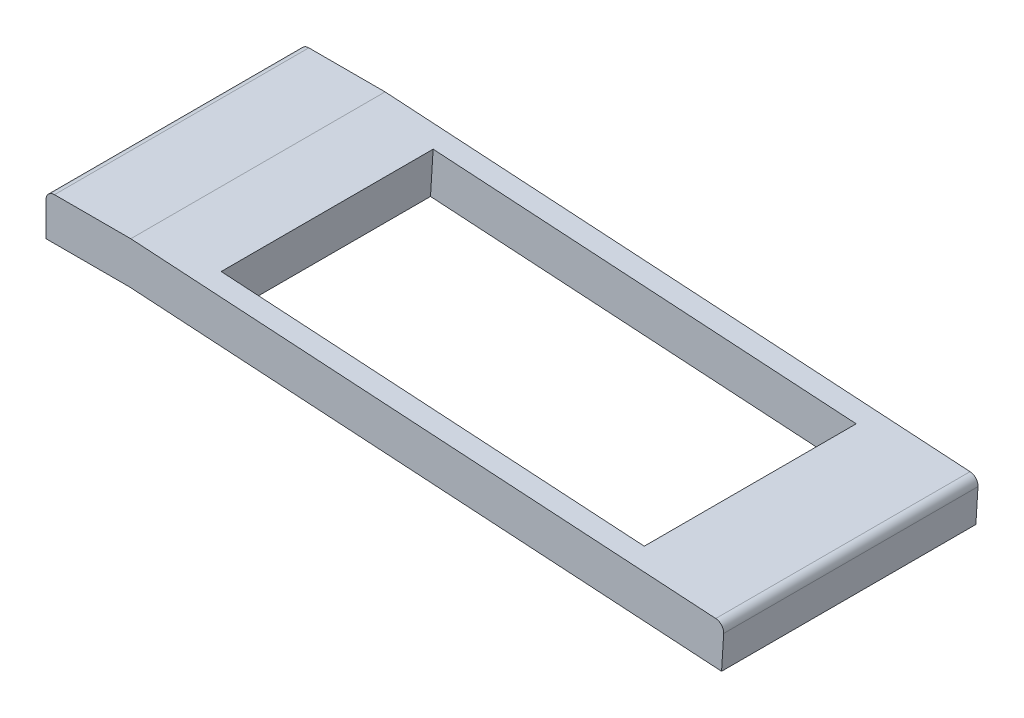
ISO-10303-21;
HEADER;
FILE_DESCRIPTION(('STEP AP214'),'2;1');
FILE_NAME('part.step','',(''),(''),'','','');
FILE_SCHEMA(('AUTOMOTIVE_DESIGN { 1 0 10303 214 1 1 1 1 }'));
ENDSEC;
DATA;
#1=APPLICATION_CONTEXT('core data for automotive mechanical design processes');
#2=APPLICATION_PROTOCOL_DEFINITION('international standard','automotive_design',2000,#1);
#3=PRODUCT_CONTEXT('',#1,'mechanical');
#4=PRODUCT('Part','Part','',(#3));
#5=PRODUCT_RELATED_PRODUCT_CATEGORY('part','',(#4));
#6=PRODUCT_DEFINITION_FORMATION('','',#4);
#7=PRODUCT_DEFINITION_CONTEXT('part definition',#1,'design');
#8=PRODUCT_DEFINITION('design','',#6,#7);
#9=PRODUCT_DEFINITION_SHAPE('','',#8);
#10=(LENGTH_UNIT() NAMED_UNIT(*) SI_UNIT(.MILLI.,.METRE.));
#11=(NAMED_UNIT(*) PLANE_ANGLE_UNIT() SI_UNIT($,.RADIAN.));
#12=(NAMED_UNIT(*) SI_UNIT($,.STERADIAN.) SOLID_ANGLE_UNIT());
#13=UNCERTAINTY_MEASURE_WITH_UNIT(LENGTH_MEASURE(1.E-05),#10,'distance_accuracy_value','');
#14=(GEOMETRIC_REPRESENTATION_CONTEXT(3) GLOBAL_UNCERTAINTY_ASSIGNED_CONTEXT((#13)) GLOBAL_UNIT_ASSIGNED_CONTEXT((#10,
#11,#12)) REPRESENTATION_CONTEXT('',''));
#15=CARTESIAN_POINT('',(0.,0.,0.));
#16=DIRECTION('',(0.,0.,1.));
#17=DIRECTION('',(1.,0.,0.));
#18=AXIS2_PLACEMENT_3D('',#15,#16,#17);
#19=CARTESIAN_POINT('',(1.,0.,3.));
#20=DIRECTION('',(-0.0621255689086749,-0.99806834119101,0.));
#21=DIRECTION('',(0.99806834119101,-0.0621255689086749,0.));
#22=AXIS2_PLACEMENT_3D('',#19,#20,#21);
#23=PLANE('',#22);
#24=DIRECTION('',(-0.99806834119101,0.0621255689086749,0.));
#25=VECTOR('',#24,1.);
#26=CARTESIAN_POINT('',(1.81747174696329,-0.0508841882373098,0.250788281548282));
#27=LINE('',#26,#25);
#28=CARTESIAN_POINT('',(6.80781345291834,-0.361512032780684,0.250788281548282));
#29=VERTEX_POINT('',#28);
#30=CARTESIAN_POINT('',(1.81747174696329,-0.0508841882373098,0.250788281548282));
#31=VERTEX_POINT('',#30);
#32=EDGE_CURVE('E145',#29,#31,#27,.T.);
#33=ORIENTED_EDGE('',*,*,#32,.F.);
#34=DIRECTION('',(0.,0.,-1.));
#35=VECTOR('',#34,1.);
#36=CARTESIAN_POINT('',(6.80781345291834,-0.361512032780684,0.250788281548282));
#37=LINE('',#36,#35);
#38=CARTESIAN_POINT('',(6.80781345291834,-0.361512032780684,2.75078828154828));
#39=VERTEX_POINT('',#38);
#40=EDGE_CURVE('E58',#39,#29,#37,.T.);
#41=ORIENTED_EDGE('',*,*,#40,.F.);
#42=DIRECTION('',(0.99806834119101,-0.0621255689086749,0.));
#43=VECTOR('',#42,1.);
#44=CARTESIAN_POINT('',(1.81747174696329,-0.0508841882373098,2.75078828154828));
#45=LINE('',#44,#43);
#46=CARTESIAN_POINT('',(1.81747174696329,-0.0508841882373098,2.75078828154828));
#47=VERTEX_POINT('',#46);
#48=EDGE_CURVE('E152',#47,#39,#45,.T.);
#49=ORIENTED_EDGE('',*,*,#48,.F.);
#50=DIRECTION('',(0.,0.,1.));
#51=VECTOR('',#50,1.);
#52=CARTESIAN_POINT('',(1.81747174696329,-0.0508841882373098,0.250788281548282));
#53=LINE('',#52,#51);
#54=EDGE_CURVE('E135',#31,#47,#53,.T.);
#55=ORIENTED_EDGE('',*,*,#54,.F.);
#56=EDGE_LOOP('',(#33,#41,#49,#55));
#57=FACE_BOUND('',#56,.T.);
#58=DIRECTION('',(-0.99806834119101,0.0621255689086749,0.));
#59=VECTOR('',#58,1.);
#60=CARTESIAN_POINT('',(1.,0.,0.));
#61=LINE('',#60,#59);
#62=CARTESIAN_POINT('',(7.9001931658809,-0.429508089093932,0.));
#63=VERTEX_POINT('',#62);
#64=CARTESIAN_POINT('',(1.,0.,0.));
#65=VERTEX_POINT('',#64);
#66=EDGE_CURVE('E162',#63,#65,#61,.T.);
#67=ORIENTED_EDGE('',*,*,#66,.T.);
#68=DIRECTION('',(0.,0.,-1.));
#69=VECTOR('',#68,1.);
#70=CARTESIAN_POINT('',(1.,0.,3.));
#71=LINE('',#70,#69);
#72=CARTESIAN_POINT('',(1.,0.,3.));
#73=VERTEX_POINT('',#72);
#74=EDGE_CURVE('E244',#73,#65,#71,.T.);
#75=ORIENTED_EDGE('',*,*,#74,.F.);
#76=DIRECTION('',(-0.99806834119101,0.0621255689086749,0.));
#77=VECTOR('',#76,1.);
#78=CARTESIAN_POINT('',(1.,0.,3.));
#79=LINE('',#78,#77);
#80=CARTESIAN_POINT('',(7.9001931658809,-0.429508089093932,3.));
#81=VERTEX_POINT('',#80);
#82=EDGE_CURVE('E167',#81,#73,#79,.T.);
#83=ORIENTED_EDGE('',*,*,#82,.F.);
#84=DIRECTION('',(0.,0.,-1.));
#85=VECTOR('',#84,1.);
#86=CARTESIAN_POINT('',(7.9001931658809,-0.429508089093932,3.));
#87=LINE('',#86,#85);
#88=EDGE_CURVE('E193',#81,#63,#87,.T.);
#89=ORIENTED_EDGE('',*,*,#88,.T.);
#90=EDGE_LOOP('',(#67,#75,#83,#89));
#91=FACE_BOUND('',#90,.T.);
#92=ADVANCED_FACE('F43',(#57,#91),#23,.F.);
#93=CARTESIAN_POINT('',(0.100000000000001,0.,3.));
#94=DIRECTION('',(0.,-1.,0.));
#95=DIRECTION('',(0.,0.,-1.));
#96=AXIS2_PLACEMENT_3D('',#93,#94,#95);
#97=PLANE('',#96);
#98=DIRECTION('',(-1.,0.,0.));
#99=VECTOR('',#98,1.);
#100=CARTESIAN_POINT('',(0.100000000000001,0.,0.));
#101=LINE('',#100,#99);
#102=CARTESIAN_POINT('',(0.100000000000001,0.,0.));
#103=VERTEX_POINT('',#102);
#104=EDGE_CURVE('E197',#65,#103,#101,.T.);
#105=ORIENTED_EDGE('',*,*,#104,.T.);
#106=DIRECTION('',(0.,0.,-1.));
#107=VECTOR('',#106,1.);
#108=CARTESIAN_POINT('',(0.100000000000001,0.,3.));
#109=LINE('',#108,#107);
#110=CARTESIAN_POINT('',(0.100000000000001,0.,3.));
#111=VERTEX_POINT('',#110);
#112=EDGE_CURVE('E240',#111,#103,#109,.T.);
#113=ORIENTED_EDGE('',*,*,#112,.F.);
#114=DIRECTION('',(-1.,0.,0.));
#115=VECTOR('',#114,1.);
#116=CARTESIAN_POINT('',(0.100000000000001,0.,3.));
#117=LINE('',#116,#115);
#118=EDGE_CURVE('E171',#73,#111,#117,.T.);
#119=ORIENTED_EDGE('',*,*,#118,.F.);
#120=ORIENTED_EDGE('',*,*,#74,.T.);
#121=EDGE_LOOP('',(#105,#113,#119,#120));
#122=FACE_BOUND('',#121,.T.);
#123=ADVANCED_FACE('F275',(#122),#97,.F.);
#124=CARTESIAN_POINT('',(0.1,-0.1,3.));
#125=DIRECTION('',(0.,0.,-1.));
#126=DIRECTION('',(-1.,0.,0.));
#127=AXIS2_PLACEMENT_3D('',#124,#125,#126);
#128=CYLINDRICAL_SURFACE('',#127,0.1);
#129=CARTESIAN_POINT('',(0.1,-0.1,0.));
#130=DIRECTION('',(0.,0.,1.));
#131=DIRECTION('',(-1.,0.,0.));
#132=AXIS2_PLACEMENT_3D('',#129,#130,#131);
#133=CIRCLE('',#132,0.1);
#134=CARTESIAN_POINT('',(0.,-0.100000000000001,0.));
#135=VERTEX_POINT('',#134);
#136=EDGE_CURVE('E200',#103,#135,#133,.T.);
#137=ORIENTED_EDGE('',*,*,#136,.T.);
#138=DIRECTION('',(0.,0.,-1.));
#139=VECTOR('',#138,1.);
#140=CARTESIAN_POINT('',(0.,-0.100000000000001,3.));
#141=LINE('',#140,#139);
#142=CARTESIAN_POINT('',(0.,-0.100000000000001,3.));
#143=VERTEX_POINT('',#142);
#144=EDGE_CURVE('E236',#143,#135,#141,.T.);
#145=ORIENTED_EDGE('',*,*,#144,.F.);
#146=CARTESIAN_POINT('',(0.1,-0.1,3.));
#147=DIRECTION('',(0.,0.,1.));
#148=DIRECTION('',(-1.,0.,0.));
#149=AXIS2_PLACEMENT_3D('',#146,#147,#148);
#150=CIRCLE('',#149,0.1);
#151=EDGE_CURVE('E175',#111,#143,#150,.T.);
#152=ORIENTED_EDGE('',*,*,#151,.F.);
#153=ORIENTED_EDGE('',*,*,#112,.T.);
#154=EDGE_LOOP('',(#137,#145,#152,#153));
#155=FACE_BOUND('',#154,.T.);
#156=ADVANCED_FACE('F279',(#155),#128,.T.);
#157=CARTESIAN_POINT('',(0.,-0.100000000000001,3.));
#158=DIRECTION('',(1.,0.,0.));
#159=DIRECTION('',(0.,0.,-1.));
#160=AXIS2_PLACEMENT_3D('',#157,#158,#159);
#161=PLANE('',#160);
#162=DIRECTION('',(0.,-1.,0.));
#163=VECTOR('',#162,1.);
#164=CARTESIAN_POINT('',(0.,-0.100000000000001,0.));
#165=LINE('',#164,#163);
#166=CARTESIAN_POINT('',(0.,-0.5,0.));
#167=VERTEX_POINT('',#166);
#168=EDGE_CURVE('E203',#135,#167,#165,.T.);
#169=ORIENTED_EDGE('',*,*,#168,.T.);
#170=DIRECTION('',(0.,0.,-1.));
#171=VECTOR('',#170,1.);
#172=CARTESIAN_POINT('',(0.,-0.5,3.));
#173=LINE('',#172,#171);
#174=CARTESIAN_POINT('',(0.,-0.5,3.));
#175=VERTEX_POINT('',#174);
#176=EDGE_CURVE('E232',#175,#167,#173,.T.);
#177=ORIENTED_EDGE('',*,*,#176,.F.);
#178=DIRECTION('',(0.,-1.,0.));
#179=VECTOR('',#178,1.);
#180=CARTESIAN_POINT('',(0.,-0.100000000000001,3.));
#181=LINE('',#180,#179);
#182=EDGE_CURVE('E178',#143,#175,#181,.T.);
#183=ORIENTED_EDGE('',*,*,#182,.F.);
#184=ORIENTED_EDGE('',*,*,#144,.T.);
#185=EDGE_LOOP('',(#169,#177,#183,#184));
#186=FACE_BOUND('',#185,.T.);
#187=ADVANCED_FACE('F284',(#186),#161,.F.);
#188=CARTESIAN_POINT('',(0.,-0.5,3.));
#189=DIRECTION('',(0.,1.,0.));
#190=DIRECTION('',(0.,0.,1.));
#191=AXIS2_PLACEMENT_3D('',#188,#189,#190);
#192=PLANE('',#191);
#193=DIRECTION('',(1.,0.,0.));
#194=VECTOR('',#193,1.);
#195=CARTESIAN_POINT('',(0.,-0.5,0.));
#196=LINE('',#195,#194);
#197=CARTESIAN_POINT('',(0.984453592595426,-0.5,0.));
#198=VERTEX_POINT('',#197);
#199=EDGE_CURVE('E206',#167,#198,#196,.T.);
#200=ORIENTED_EDGE('',*,*,#199,.T.);
#201=DIRECTION('',(0.,0.,-1.));
#202=VECTOR('',#201,1.);
#203=CARTESIAN_POINT('',(0.984453592595426,-0.5,3.));
#204=LINE('',#203,#202);
#205=CARTESIAN_POINT('',(0.984453592595426,-0.5,3.));
#206=VERTEX_POINT('',#205);
#207=EDGE_CURVE('E228',#206,#198,#204,.T.);
#208=ORIENTED_EDGE('',*,*,#207,.F.);
#209=DIRECTION('',(1.,0.,0.));
#210=VECTOR('',#209,1.);
#211=CARTESIAN_POINT('',(0.,-0.5,3.));
#212=LINE('',#211,#210);
#213=EDGE_CURVE('E181',#175,#206,#212,.T.);
#214=ORIENTED_EDGE('',*,*,#213,.F.);
#215=ORIENTED_EDGE('',*,*,#176,.T.);
#216=EDGE_LOOP('',(#200,#208,#214,#215));
#217=FACE_BOUND('',#216,.T.);
#218=ADVANCED_FACE('F290',(#217),#192,.F.);
#219=CARTESIAN_POINT('',(0.984453592595426,-0.5,3.));
#220=DIRECTION('',(0.0621255689086749,0.99806834119101,0.));
#221=DIRECTION('',(-0.99806834119101,0.0621255689086749,0.));
#222=AXIS2_PLACEMENT_3D('',#219,#220,#221);
#223=PLANE('',#222);
#224=DIRECTION('',(0.99806834119101,-0.0621255689086749,0.));
#225=VECTOR('',#224,1.);
#226=CARTESIAN_POINT('',(0.984453592595426,-0.5,2.75078828154828));
#227=LINE('',#226,#225);
#228=CARTESIAN_POINT('',(1.78640896250895,-0.549918358832815,2.75078828154828));
#229=VERTEX_POINT('',#228);
#230=CARTESIAN_POINT('',(6.776750668464,-0.86054620337619,2.75078828154828));
#231=VERTEX_POINT('',#230);
#232=EDGE_CURVE('E51',#229,#231,#227,.T.);
#233=ORIENTED_EDGE('',*,*,#232,.T.);
#234=DIRECTION('',(0.,0.,-1.));
#235=VECTOR('',#234,1.);
#236=CARTESIAN_POINT('',(6.776750668464,-0.860546203376189,3.));
#237=LINE('',#236,#235);
#238=CARTESIAN_POINT('',(6.776750668464,-0.86054620337619,0.250788281548282));
#239=VERTEX_POINT('',#238);
#240=EDGE_CURVE('E11',#231,#239,#237,.T.);
#241=ORIENTED_EDGE('',*,*,#240,.T.);
#242=DIRECTION('',(-0.99806834119101,0.0621255689086749,0.));
#243=VECTOR('',#242,1.);
#244=CARTESIAN_POINT('',(0.984453592595426,-0.5,0.250788281548282));
#245=LINE('',#244,#243);
#246=CARTESIAN_POINT('',(1.78640896250895,-0.549918358832815,0.250788281548282));
#247=VERTEX_POINT('',#246);
#248=EDGE_CURVE('E248',#239,#247,#245,.T.);
#249=ORIENTED_EDGE('',*,*,#248,.T.);
#250=DIRECTION('',(0.,0.,1.));
#251=VECTOR('',#250,1.);
#252=CARTESIAN_POINT('',(1.78640896250895,-0.549918358832814,3.));
#253=LINE('',#252,#251);
#254=EDGE_CURVE('E138',#247,#229,#253,.T.);
#255=ORIENTED_EDGE('',*,*,#254,.T.);
#256=EDGE_LOOP('',(#233,#241,#249,#255));
#257=FACE_BOUND('',#256,.T.);
#258=DIRECTION('',(0.99806834119101,-0.0621255689086749,0.));
#259=VECTOR('',#258,1.);
#260=CARTESIAN_POINT('',(0.984453592595426,-0.5,0.));
#261=LINE('',#260,#259);
#262=CARTESIAN_POINT('',(7.96893721554566,-0.934754816580305,0.));
#263=VERTEX_POINT('',#262);
#264=EDGE_CURVE('E209',#198,#263,#261,.T.);
#265=ORIENTED_EDGE('',*,*,#264,.T.);
#266=DIRECTION('',(0.,0.,-1.));
#267=VECTOR('',#266,1.);
#268=CARTESIAN_POINT('',(7.96893721554566,-0.934754816580305,3.));
#269=LINE('',#268,#267);
#270=CARTESIAN_POINT('',(7.96893721554566,-0.934754816580305,3.));
#271=VERTEX_POINT('',#270);
#272=EDGE_CURVE('E224',#271,#263,#269,.T.);
#273=ORIENTED_EDGE('',*,*,#272,.F.);
#274=DIRECTION('',(0.99806834119101,-0.0621255689086749,0.));
#275=VECTOR('',#274,1.);
#276=CARTESIAN_POINT('',(0.984453592595426,-0.5,3.));
#277=LINE('',#276,#275);
#278=EDGE_CURVE('E184',#206,#271,#277,.T.);
#279=ORIENTED_EDGE('',*,*,#278,.F.);
#280=ORIENTED_EDGE('',*,*,#207,.T.);
#281=EDGE_LOOP('',(#265,#273,#279,#280));
#282=FACE_BOUND('',#281,.T.);
#283=ADVANCED_FACE('F255',(#257,#282),#223,.F.);
#284=CARTESIAN_POINT('',(7.99378744310913,-0.535527480103901,3.));
#285=DIRECTION('',(-0.99806834119101,0.0621255689086743,0.));
#286=DIRECTION('',(-0.0621255689086743,-0.99806834119101,0.));
#287=AXIS2_PLACEMENT_3D('',#284,#285,#286);
#288=PLANE('',#287);
#289=DIRECTION('',(0.0621255689086743,0.99806834119101,0.));
#290=VECTOR('',#289,1.);
#291=CARTESIAN_POINT('',(7.99378744310913,-0.535527480103901,0.));
#292=LINE('',#291,#290);
#293=CARTESIAN_POINT('',(7.99378744310913,-0.535527480103901,0.));
#294=VERTEX_POINT('',#293);
#295=EDGE_CURVE('E212',#263,#294,#292,.T.);
#296=ORIENTED_EDGE('',*,*,#295,.T.);
#297=DIRECTION('',(0.,0.,-1.));
#298=VECTOR('',#297,1.);
#299=CARTESIAN_POINT('',(7.99378744310913,-0.535527480103901,3.));
#300=LINE('',#299,#298);
#301=CARTESIAN_POINT('',(7.99378744310913,-0.535527480103901,3.));
#302=VERTEX_POINT('',#301);
#303=EDGE_CURVE('E220',#302,#294,#300,.T.);
#304=ORIENTED_EDGE('',*,*,#303,.F.);
#305=DIRECTION('',(0.0621255689086743,0.99806834119101,0.));
#306=VECTOR('',#305,1.);
#307=CARTESIAN_POINT('',(7.99378744310913,-0.535527480103901,3.));
#308=LINE('',#307,#306);
#309=EDGE_CURVE('E187',#271,#302,#308,.T.);
#310=ORIENTED_EDGE('',*,*,#309,.F.);
#311=ORIENTED_EDGE('',*,*,#272,.T.);
#312=EDGE_LOOP('',(#296,#304,#310,#311));
#313=FACE_BOUND('',#312,.T.);
#314=ADVANCED_FACE('F297',(#313),#288,.F.);
#315=CARTESIAN_POINT('',(7.89398060899003,-0.529314923213033,3.));
#316=DIRECTION('',(0.,0.,-1.));
#317=DIRECTION('',(-1.,0.,0.));
#318=AXIS2_PLACEMENT_3D('',#315,#316,#317);
#319=CYLINDRICAL_SURFACE('',#318,0.1);
#320=CARTESIAN_POINT('',(7.89398060899003,-0.529314923213033,0.));
#321=DIRECTION('',(0.,0.,1.));
#322=DIRECTION('',(-1.,0.,0.));
#323=AXIS2_PLACEMENT_3D('',#320,#321,#322);
#324=CIRCLE('',#323,0.1);
#325=EDGE_CURVE('E172',#294,#63,#324,.T.);
#326=ORIENTED_EDGE('',*,*,#325,.T.);
#327=ORIENTED_EDGE('',*,*,#88,.F.);
#328=CARTESIAN_POINT('',(7.89398060899003,-0.529314923213033,3.));
#329=DIRECTION('',(0.,0.,1.));
#330=DIRECTION('',(-1.,0.,0.));
#331=AXIS2_PLACEMENT_3D('',#328,#329,#330);
#332=CIRCLE('',#331,0.1);
#333=EDGE_CURVE('E190',#302,#81,#332,.T.);
#334=ORIENTED_EDGE('',*,*,#333,.F.);
#335=ORIENTED_EDGE('',*,*,#303,.T.);
#336=EDGE_LOOP('',(#326,#327,#334,#335));
#337=FACE_BOUND('',#336,.T.);
#338=ADVANCED_FACE('F300',(#337),#319,.T.);
#339=CARTESIAN_POINT('',(7.89398060899003,-0.529314923213033,3.));
#340=DIRECTION('',(0.,0.,-1.));
#341=DIRECTION('',(-1.,0.,0.));
#342=AXIS2_PLACEMENT_3D('',#339,#340,#341);
#343=PLANE('',#342);
#344=ORIENTED_EDGE('',*,*,#82,.T.);
#345=ORIENTED_EDGE('',*,*,#118,.T.);
#346=ORIENTED_EDGE('',*,*,#151,.T.);
#347=ORIENTED_EDGE('',*,*,#182,.T.);
#348=ORIENTED_EDGE('',*,*,#213,.T.);
#349=ORIENTED_EDGE('',*,*,#278,.T.);
#350=ORIENTED_EDGE('',*,*,#309,.T.);
#351=ORIENTED_EDGE('',*,*,#333,.T.);
#352=EDGE_LOOP('',(#344,#345,#346,#347,#348,#349,#350,#351));
#353=FACE_BOUND('',#352,.T.);
#354=ADVANCED_FACE('F269',(#353),#343,.F.);
#355=CARTESIAN_POINT('',(7.89398060899003,-0.529314923213033,0.));
#356=DIRECTION('',(0.,0.,-1.));
#357=DIRECTION('',(-1.,0.,0.));
#358=AXIS2_PLACEMENT_3D('',#355,#356,#357);
#359=PLANE('',#358);
#360=ORIENTED_EDGE('',*,*,#66,.F.);
#361=ORIENTED_EDGE('',*,*,#325,.F.);
#362=ORIENTED_EDGE('',*,*,#295,.F.);
#363=ORIENTED_EDGE('',*,*,#264,.F.);
#364=ORIENTED_EDGE('',*,*,#199,.F.);
#365=ORIENTED_EDGE('',*,*,#168,.F.);
#366=ORIENTED_EDGE('',*,*,#136,.F.);
#367=ORIENTED_EDGE('',*,*,#104,.F.);
#368=EDGE_LOOP('',(#360,#361,#362,#363,#364,#365,#366,#367));
#369=FACE_BOUND('',#368,.T.);
#370=ADVANCED_FACE('F262',(#369),#359,.T.);
#371=CARTESIAN_POINT('',(6.62143674619231,-3.35571705635371,0.250788281548282));
#372=DIRECTION('',(0.99806834119101,-0.0621255689086749,0.));
#373=DIRECTION('',(0.0621255689086749,0.99806834119101,0.));
#374=AXIS2_PLACEMENT_3D('',#371,#372,#373);
#375=PLANE('',#374);
#376=DIRECTION('',(0.0621255689086749,0.99806834119101,0.));
#377=VECTOR('',#376,1.);
#378=CARTESIAN_POINT('',(6.62143674619231,-3.35571705635371,2.75078828154828));
#379=LINE('',#378,#377);
#380=EDGE_CURVE('E159',#231,#39,#379,.T.);
#381=ORIENTED_EDGE('',*,*,#380,.T.);
#382=ORIENTED_EDGE('',*,*,#40,.T.);
#383=DIRECTION('',(0.0621255689086749,0.99806834119101,0.));
#384=VECTOR('',#383,1.);
#385=CARTESIAN_POINT('',(6.62143674619231,-3.35571705635371,0.250788281548282));
#386=LINE('',#385,#384);
#387=EDGE_CURVE('E142',#239,#29,#386,.T.);
#388=ORIENTED_EDGE('',*,*,#387,.F.);
#389=ORIENTED_EDGE('',*,*,#240,.F.);
#390=EDGE_LOOP('',(#381,#382,#388,#389));
#391=FACE_BOUND('',#390,.T.);
#392=ADVANCED_FACE('F260',(#391),#375,.F.);
#393=CARTESIAN_POINT('',(1.63109504023727,-3.04508921181034,2.75078828154828));
#394=DIRECTION('',(0.,0.,1.));
#395=DIRECTION('',(1.,0.,0.));
#396=AXIS2_PLACEMENT_3D('',#393,#394,#395);
#397=PLANE('',#396);
#398=DIRECTION('',(0.0621255689086749,0.99806834119101,0.));
#399=VECTOR('',#398,1.);
#400=CARTESIAN_POINT('',(1.63109504023727,-3.04508921181034,2.75078828154828));
#401=LINE('',#400,#399);
#402=EDGE_CURVE('E141',#229,#47,#401,.T.);
#403=ORIENTED_EDGE('',*,*,#402,.T.);
#404=ORIENTED_EDGE('',*,*,#48,.T.);
#405=ORIENTED_EDGE('',*,*,#380,.F.);
#406=ORIENTED_EDGE('',*,*,#232,.F.);
#407=EDGE_LOOP('',(#403,#404,#405,#406));
#408=FACE_BOUND('',#407,.T.);
#409=ADVANCED_FACE('F259',(#408),#397,.F.);
#410=CARTESIAN_POINT('',(1.63109504023727,-3.04508921181034,0.250788281548282));
#411=DIRECTION('',(-0.99806834119101,0.0621255689086749,0.));
#412=DIRECTION('',(-0.0621255689086749,-0.99806834119101,0.));
#413=AXIS2_PLACEMENT_3D('',#410,#411,#412);
#414=PLANE('',#413);
#415=DIRECTION('',(0.0621255689086749,0.99806834119101,0.));
#416=VECTOR('',#415,1.);
#417=CARTESIAN_POINT('',(1.63109504023727,-3.04508921181034,0.250788281548282));
#418=LINE('',#417,#416);
#419=EDGE_CURVE('E66',#247,#31,#418,.T.);
#420=ORIENTED_EDGE('',*,*,#419,.T.);
#421=ORIENTED_EDGE('',*,*,#54,.T.);
#422=ORIENTED_EDGE('',*,*,#402,.F.);
#423=ORIENTED_EDGE('',*,*,#254,.F.);
#424=EDGE_LOOP('',(#420,#421,#422,#423));
#425=FACE_BOUND('',#424,.T.);
#426=ADVANCED_FACE('F132',(#425),#414,.F.);
#427=CARTESIAN_POINT('',(1.63109504023727,-3.04508921181034,0.250788281548282));
#428=DIRECTION('',(0.,0.,-1.));
#429=DIRECTION('',(-1.,0.,0.));
#430=AXIS2_PLACEMENT_3D('',#427,#428,#429);
#431=PLANE('',#430);
#432=ORIENTED_EDGE('',*,*,#387,.T.);
#433=ORIENTED_EDGE('',*,*,#32,.T.);
#434=ORIENTED_EDGE('',*,*,#419,.F.);
#435=ORIENTED_EDGE('',*,*,#248,.F.);
#436=EDGE_LOOP('',(#432,#433,#434,#435));
#437=FACE_BOUND('',#436,.T.);
#438=ADVANCED_FACE('F146',(#437),#431,.F.);
#439=CLOSED_SHELL('',(#92,#123,#156,#187,#218,#283,#314,#338,#354,#370,#392,#409,#426,#438));
#440=MANIFOLD_SOLID_BREP('B2',#439);
#441=ADVANCED_BREP_SHAPE_REPRESENTATION('',(#18,#440),#14);
#442=SHAPE_DEFINITION_REPRESENTATION(#9,#441);
ENDSEC;
END-ISO-10303-21;
